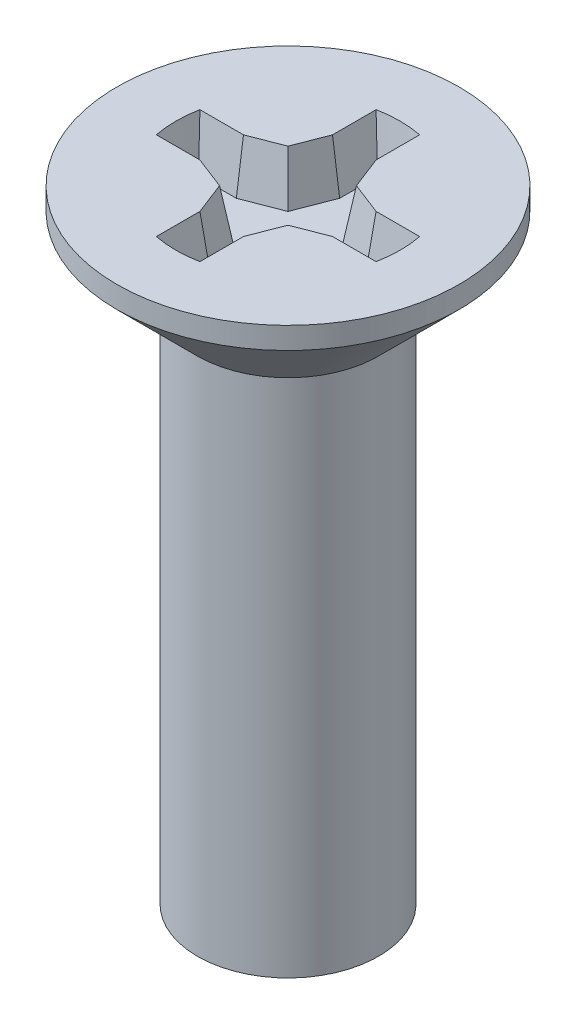
ISO-10303-21;
HEADER;
FILE_DESCRIPTION(('STEP AP214'),'2;1');
FILE_NAME('part.step','',(''),(''),'','','');
FILE_SCHEMA(('AUTOMOTIVE_DESIGN { 1 0 10303 214 1 1 1 1 }'));
ENDSEC;
DATA;
#1=APPLICATION_CONTEXT('core data for automotive mechanical design processes');
#2=APPLICATION_PROTOCOL_DEFINITION('international standard','automotive_design',2000,#1);
#3=PRODUCT_CONTEXT('',#1,'mechanical');
#4=PRODUCT('Part','Part','',(#3));
#5=PRODUCT_RELATED_PRODUCT_CATEGORY('part','',(#4));
#6=PRODUCT_DEFINITION_FORMATION('','',#4);
#7=PRODUCT_DEFINITION_CONTEXT('part definition',#1,'design');
#8=PRODUCT_DEFINITION('design','',#6,#7);
#9=PRODUCT_DEFINITION_SHAPE('','',#8);
#10=(LENGTH_UNIT() NAMED_UNIT(*) SI_UNIT(.MILLI.,.METRE.));
#11=(NAMED_UNIT(*) PLANE_ANGLE_UNIT() SI_UNIT($,.RADIAN.));
#12=(NAMED_UNIT(*) SI_UNIT($,.STERADIAN.) SOLID_ANGLE_UNIT());
#13=UNCERTAINTY_MEASURE_WITH_UNIT(LENGTH_MEASURE(1.E-05),#10,'distance_accuracy_value','');
#14=(GEOMETRIC_REPRESENTATION_CONTEXT(3) GLOBAL_UNCERTAINTY_ASSIGNED_CONTEXT((#13)) GLOBAL_UNIT_ASSIGNED_CONTEXT((#10,
#11,#12)) REPRESENTATION_CONTEXT('',''));
#15=CARTESIAN_POINT('',(0.,0.,0.));
#16=DIRECTION('',(0.,0.,1.));
#17=DIRECTION('',(1.,0.,0.));
#18=AXIS2_PLACEMENT_3D('',#15,#16,#17);
#19=CARTESIAN_POINT('',(0.,0.6475,0.));
#20=DIRECTION('',(0.,1.,0.));
#21=DIRECTION('',(0.,0.,-1.));
#22=AXIS2_PLACEMENT_3D('',#19,#20,#21);
#23=CONICAL_SURFACE('',#22,2.1025,0.785398163397449);
#24=CARTESIAN_POINT('',(0.,0.,0.));
#25=DIRECTION('',(0.,-1.,0.));
#26=DIRECTION('',(1.,0.,0.));
#27=AXIS2_PLACEMENT_3D('',#24,#25,#26);
#28=CIRCLE('',#27,1.455);
#29=CARTESIAN_POINT('',(0.,0.,-1.455));
#30=VERTEX_POINT('',#29);
#31=EDGE_CURVE('E417',#30,#30,#28,.T.);
#32=ORIENTED_EDGE('',*,*,#31,.F.);
#33=EDGE_LOOP('',(#32));
#34=FACE_BOUND('',#33,.T.);
#35=CARTESIAN_POINT('',(0.,1.295,0.));
#36=DIRECTION('',(0.,-1.,0.));
#37=DIRECTION('',(1.,0.,0.));
#38=AXIS2_PLACEMENT_3D('',#35,#36,#37);
#39=CIRCLE('',#38,2.75);
#40=CARTESIAN_POINT('',(0.,1.295,-2.75));
#41=VERTEX_POINT('',#40);
#42=EDGE_CURVE('E11',#41,#41,#39,.T.);
#43=ORIENTED_EDGE('',*,*,#42,.T.);
#44=EDGE_LOOP('',(#43));
#45=FACE_BOUND('',#44,.T.);
#46=ADVANCED_FACE('F16',(#34,#45),#23,.T.);
#47=CARTESIAN_POINT('',(0.,1.47,0.));
#48=DIRECTION('',(0.,-1.,0.));
#49=DIRECTION('',(0.,0.,-1.));
#50=AXIS2_PLACEMENT_3D('',#47,#48,#49);
#51=CYLINDRICAL_SURFACE('',#50,2.75);
#52=ORIENTED_EDGE('',*,*,#42,.F.);
#53=EDGE_LOOP('',(#52));
#54=FACE_BOUND('',#53,.T.);
#55=CARTESIAN_POINT('',(0.,1.645,0.));
#56=DIRECTION('',(0.,-1.,0.));
#57=DIRECTION('',(1.,0.,0.));
#58=AXIS2_PLACEMENT_3D('',#55,#56,#57);
#59=CIRCLE('',#58,2.75);
#60=CARTESIAN_POINT('',(0.,1.645,-2.75));
#61=VERTEX_POINT('',#60);
#62=EDGE_CURVE('E24',#61,#61,#59,.T.);
#63=ORIENTED_EDGE('',*,*,#62,.T.);
#64=EDGE_LOOP('',(#63));
#65=FACE_BOUND('',#64,.T.);
#66=ADVANCED_FACE('F500',(#54,#65),#51,.T.);
#67=CARTESIAN_POINT('',(0.,1.645,-2.75));
#68=DIRECTION('',(0.,1.,0.));
#69=DIRECTION('',(0.,0.,1.));
#70=AXIS2_PLACEMENT_3D('',#67,#68,#69);
#71=PLANE('',#70);
#72=DIRECTION('',(-0.361616294640554,0.,-0.932327011005493));
#73=VECTOR('',#72,1.);
#74=CARTESIAN_POINT('',(-0.35,1.645,1.06564435830096));
#75=LINE('',#74,#73);
#76=CARTESIAN_POINT('',(-0.35,1.645,1.06564435830096));
#77=VERTEX_POINT('',#76);
#78=CARTESIAN_POINT('',(-0.55,1.645,0.55));
#79=VERTEX_POINT('',#78);
#80=EDGE_CURVE('E165',#77,#79,#75,.T.);
#81=ORIENTED_EDGE('',*,*,#80,.T.);
#82=DIRECTION('',(-0.932327011005493,0.,-0.361616294640553));
#83=VECTOR('',#82,1.);
#84=CARTESIAN_POINT('',(-0.55,1.645,0.55));
#85=LINE('',#84,#83);
#86=CARTESIAN_POINT('',(-1.06564435830096,1.645,0.35));
#87=VERTEX_POINT('',#86);
#88=EDGE_CURVE('E411',#79,#87,#85,.T.);
#89=ORIENTED_EDGE('',*,*,#88,.T.);
#90=DIRECTION('',(-1.,0.,0.));
#91=VECTOR('',#90,1.);
#92=CARTESIAN_POINT('',(-1.06564435830096,1.645,0.35));
#93=LINE('',#92,#91);
#94=CARTESIAN_POINT('',(-1.76564435830096,1.645,0.35));
#95=VERTEX_POINT('',#94);
#96=EDGE_CURVE('E401',#87,#95,#93,.T.);
#97=ORIENTED_EDGE('',*,*,#96,.T.);
#98=CARTESIAN_POINT('',(0.,1.645,0.));
#99=DIRECTION('',(0.,-1.,0.));
#100=DIRECTION('',(0.980913532389421,0.,0.194444444444445));
#101=AXIS2_PLACEMENT_3D('',#98,#99,#100);
#102=CIRCLE('',#101,1.8);
#103=CARTESIAN_POINT('',(-1.76564435830096,1.645,-0.35));
#104=VERTEX_POINT('',#103);
#105=EDGE_CURVE('E386',#95,#104,#102,.T.);
#106=ORIENTED_EDGE('',*,*,#105,.T.);
#107=DIRECTION('',(1.,0.,0.));
#108=VECTOR('',#107,1.);
#109=CARTESIAN_POINT('',(-1.76564435830096,1.645,-0.35));
#110=LINE('',#109,#108);
#111=CARTESIAN_POINT('',(-1.06564435830096,1.645,-0.35));
#112=VERTEX_POINT('',#111);
#113=EDGE_CURVE('E371',#104,#112,#110,.T.);
#114=ORIENTED_EDGE('',*,*,#113,.T.);
#115=DIRECTION('',(0.932327011005492,0.,-0.361616294640555));
#116=VECTOR('',#115,1.);
#117=CARTESIAN_POINT('',(-1.06564435830096,1.645,-0.35));
#118=LINE('',#117,#116);
#119=CARTESIAN_POINT('',(-0.55,1.645,-0.55));
#120=VERTEX_POINT('',#119);
#121=EDGE_CURVE('E361',#112,#120,#118,.T.);
#122=ORIENTED_EDGE('',*,*,#121,.T.);
#123=DIRECTION('',(0.361616294640554,0.,-0.932327011005493));
#124=VECTOR('',#123,1.);
#125=CARTESIAN_POINT('',(-0.55,1.645,-0.55));
#126=LINE('',#125,#124);
#127=CARTESIAN_POINT('',(-0.35,1.645,-1.06564435830096));
#128=VERTEX_POINT('',#127);
#129=EDGE_CURVE('E351',#120,#128,#126,.T.);
#130=ORIENTED_EDGE('',*,*,#129,.T.);
#131=DIRECTION('',(0.,0.,-1.));
#132=VECTOR('',#131,1.);
#133=CARTESIAN_POINT('',(-0.35,1.645,-1.06564435830096));
#134=LINE('',#133,#132);
#135=CARTESIAN_POINT('',(-0.35,1.645,-1.76564435830095));
#136=VERTEX_POINT('',#135);
#137=EDGE_CURVE('E341',#128,#136,#134,.T.);
#138=ORIENTED_EDGE('',*,*,#137,.T.);
#139=CARTESIAN_POINT('',(0.,1.645,0.));
#140=DIRECTION('',(0.,-1.,0.));
#141=DIRECTION('',(-0.194444444444444,0.,0.980913532389421));
#142=AXIS2_PLACEMENT_3D('',#139,#140,#141);
#143=CIRCLE('',#142,1.8);
#144=CARTESIAN_POINT('',(0.35,1.645,-1.76564435830095));
#145=VERTEX_POINT('',#144);
#146=EDGE_CURVE('E326',#136,#145,#143,.T.);
#147=ORIENTED_EDGE('',*,*,#146,.T.);
#148=DIRECTION('',(0.,0.,1.));
#149=VECTOR('',#148,1.);
#150=CARTESIAN_POINT('',(0.35,1.645,-1.76564435830095));
#151=LINE('',#150,#149);
#152=CARTESIAN_POINT('',(0.35,1.645,-1.06564435830096));
#153=VERTEX_POINT('',#152);
#154=EDGE_CURVE('E311',#145,#153,#151,.T.);
#155=ORIENTED_EDGE('',*,*,#154,.T.);
#156=DIRECTION('',(0.361616294640555,0.,0.932327011005492));
#157=VECTOR('',#156,1.);
#158=CARTESIAN_POINT('',(0.35,1.645,-1.06564435830096));
#159=LINE('',#158,#157);
#160=CARTESIAN_POINT('',(0.55,1.645,-0.55));
#161=VERTEX_POINT('',#160);
#162=EDGE_CURVE('E301',#153,#161,#159,.T.);
#163=ORIENTED_EDGE('',*,*,#162,.T.);
#164=DIRECTION('',(0.932327011005493,0.,0.361616294640554));
#165=VECTOR('',#164,1.);
#166=CARTESIAN_POINT('',(0.55,1.645,-0.55));
#167=LINE('',#166,#165);
#168=CARTESIAN_POINT('',(1.06564435830096,1.645,-0.35));
#169=VERTEX_POINT('',#168);
#170=EDGE_CURVE('E291',#161,#169,#167,.T.);
#171=ORIENTED_EDGE('',*,*,#170,.T.);
#172=DIRECTION('',(1.,0.,0.));
#173=VECTOR('',#172,1.);
#174=CARTESIAN_POINT('',(1.06564435830096,1.645,-0.35));
#175=LINE('',#174,#173);
#176=CARTESIAN_POINT('',(1.76564435830096,1.645,-0.35));
#177=VERTEX_POINT('',#176);
#178=EDGE_CURVE('E281',#169,#177,#175,.T.);
#179=ORIENTED_EDGE('',*,*,#178,.T.);
#180=CARTESIAN_POINT('',(0.,1.645,0.));
#181=DIRECTION('',(0.,-1.,0.));
#182=DIRECTION('',(-0.980913532389421,0.,-0.194444444444444));
#183=AXIS2_PLACEMENT_3D('',#180,#181,#182);
#184=CIRCLE('',#183,1.8);
#185=CARTESIAN_POINT('',(1.76564435830096,1.645,0.35));
#186=VERTEX_POINT('',#185);
#187=EDGE_CURVE('E266',#177,#186,#184,.T.);
#188=ORIENTED_EDGE('',*,*,#187,.T.);
#189=DIRECTION('',(-1.,0.,0.));
#190=VECTOR('',#189,1.);
#191=CARTESIAN_POINT('',(1.76564435830096,1.645,0.35));
#192=LINE('',#191,#190);
#193=CARTESIAN_POINT('',(1.06564435830096,1.645,0.35));
#194=VERTEX_POINT('',#193);
#195=EDGE_CURVE('E251',#186,#194,#192,.T.);
#196=ORIENTED_EDGE('',*,*,#195,.T.);
#197=DIRECTION('',(-0.932327011005492,0.,0.361616294640555));
#198=VECTOR('',#197,1.);
#199=CARTESIAN_POINT('',(1.06564435830096,1.645,0.35));
#200=LINE('',#199,#198);
#201=CARTESIAN_POINT('',(0.55,1.645,0.55));
#202=VERTEX_POINT('',#201);
#203=EDGE_CURVE('E241',#194,#202,#200,.T.);
#204=ORIENTED_EDGE('',*,*,#203,.T.);
#205=DIRECTION('',(-0.361616294640554,0.,0.932327011005493));
#206=VECTOR('',#205,1.);
#207=CARTESIAN_POINT('',(0.55,1.645,0.55));
#208=LINE('',#207,#206);
#209=CARTESIAN_POINT('',(0.35,1.645,1.06564435830096));
#210=VERTEX_POINT('',#209);
#211=EDGE_CURVE('E231',#202,#210,#208,.T.);
#212=ORIENTED_EDGE('',*,*,#211,.T.);
#213=DIRECTION('',(0.,0.,1.));
#214=VECTOR('',#213,1.);
#215=CARTESIAN_POINT('',(0.35,1.645,1.06564435830096));
#216=LINE('',#215,#214);
#217=CARTESIAN_POINT('',(0.35,1.645,1.76564435830096));
#218=VERTEX_POINT('',#217);
#219=EDGE_CURVE('E221',#210,#218,#216,.T.);
#220=ORIENTED_EDGE('',*,*,#219,.T.);
#221=CARTESIAN_POINT('',(0.,1.645,0.));
#222=DIRECTION('',(0.,-1.,0.));
#223=DIRECTION('',(0.194444444444444,0.,-0.980913532389421));
#224=AXIS2_PLACEMENT_3D('',#221,#222,#223);
#225=CIRCLE('',#224,1.8);
#226=CARTESIAN_POINT('',(-0.35,1.645,1.76564435830096));
#227=VERTEX_POINT('',#226);
#228=EDGE_CURVE('E167',#218,#227,#225,.T.);
#229=ORIENTED_EDGE('',*,*,#228,.T.);
#230=DIRECTION('',(0.,0.,-1.));
#231=VECTOR('',#230,1.);
#232=CARTESIAN_POINT('',(-0.35,1.645,1.76564435830096));
#233=LINE('',#232,#231);
#234=EDGE_CURVE('E160',#227,#77,#233,.T.);
#235=ORIENTED_EDGE('',*,*,#234,.T.);
#236=EDGE_LOOP('',(#81,#89,#97,#106,#114,#122,#130,#138,#147,#155,#163,#171,#179,#188,#196,#204,
#212,#220,#229,#235));
#237=FACE_BOUND('',#236,.T.);
#238=ORIENTED_EDGE('',*,*,#62,.F.);
#239=EDGE_LOOP('',(#238));
#240=FACE_BOUND('',#239,.T.);
#241=ADVANCED_FACE('F162',(#237,#240),#71,.T.);
#242=CARTESIAN_POINT('',(0.,-8.355,0.));
#243=DIRECTION('',(0.,-1.,0.));
#244=DIRECTION('',(0.,0.,-1.));
#245=AXIS2_PLACEMENT_3D('',#242,#243,#244);
#246=PLANE('',#245);
#247=CARTESIAN_POINT('',(0.,-8.355,0.));
#248=DIRECTION('',(0.,-1.,0.));
#249=DIRECTION('',(1.,0.,0.));
#250=AXIS2_PLACEMENT_3D('',#247,#248,#249);
#251=CIRCLE('',#250,1.455);
#252=CARTESIAN_POINT('',(0.,-8.355,-1.455));
#253=VERTEX_POINT('',#252);
#254=EDGE_CURVE('E420',#253,#253,#251,.T.);
#255=ORIENTED_EDGE('',*,*,#254,.T.);
#256=EDGE_LOOP('',(#255));
#257=FACE_BOUND('',#256,.T.);
#258=ADVANCED_FACE('F490',(#257),#246,.T.);
#259=CARTESIAN_POINT('',(0.,-4.1775,0.));
#260=DIRECTION('',(0.,-1.,0.));
#261=DIRECTION('',(0.,0.,-1.));
#262=AXIS2_PLACEMENT_3D('',#259,#260,#261);
#263=CYLINDRICAL_SURFACE('',#262,1.455);
#264=ORIENTED_EDGE('',*,*,#254,.F.);
#265=EDGE_LOOP('',(#264));
#266=FACE_BOUND('',#265,.T.);
#267=ORIENTED_EDGE('',*,*,#31,.T.);
#268=EDGE_LOOP('',(#267));
#269=FACE_BOUND('',#268,.T.);
#270=ADVANCED_FACE('F492',(#266,#269),#263,.T.);
#271=CARTESIAN_POINT('',(-0.925519669670004,0.845,0.));
#272=DIRECTION('',(0.,1.,0.));
#273=DIRECTION('',(0.,0.,1.));
#274=AXIS2_PLACEMENT_3D('',#271,#272,#273);
#275=PLANE('',#274);
#276=DIRECTION('',(-0.932327011005493,0.,-0.361616294640553));
#277=VECTOR('',#276,1.);
#278=CARTESIAN_POINT('',(-0.440983179903434,0.845,0.440983179903433));
#279=LINE('',#278,#277);
#280=CARTESIAN_POINT('',(-0.440983179903434,0.845,0.440983179903433));
#281=VERTEX_POINT('',#280);
#282=CARTESIAN_POINT('',(-1.03924604826511,0.845,0.208938415433228));
#283=VERTEX_POINT('',#282);
#284=EDGE_CURVE('E414',#281,#283,#279,.T.);
#285=ORIENTED_EDGE('',*,*,#284,.F.);
#286=DIRECTION('',(-0.361616294640555,0.,-0.932327011005492));
#287=VECTOR('',#286,1.);
#288=CARTESIAN_POINT('',(-0.208938415433227,0.845,1.03924604826511));
#289=LINE('',#288,#287);
#290=CARTESIAN_POINT('',(-0.208938415433227,0.845,1.03924604826511));
#291=VERTEX_POINT('',#290);
#292=EDGE_CURVE('E184',#291,#281,#289,.T.);
#293=ORIENTED_EDGE('',*,*,#292,.F.);
#294=DIRECTION('',(0.,0.,-1.));
#295=VECTOR('',#294,1.);
#296=CARTESIAN_POINT('',(-0.208938415433227,0.845,1.64572822931259));
#297=LINE('',#296,#295);
#298=CARTESIAN_POINT('',(-0.208938415433227,0.845,1.64572822931259));
#299=VERTEX_POINT('',#298);
#300=EDGE_CURVE('E179',#299,#291,#297,.T.);
#301=ORIENTED_EDGE('',*,*,#300,.F.);
#302=CARTESIAN_POINT('',(0.,0.845,0.));
#303=DIRECTION('',(0.,-1.,0.));
#304=DIRECTION('',(0.194444444444444,0.,-0.980913532389421));
#305=AXIS2_PLACEMENT_3D('',#302,#303,#304);
#306=CIRCLE('',#305,1.65893841543323);
#307=CARTESIAN_POINT('',(0.208938415433228,0.845,1.64572822931259));
#308=VERTEX_POINT('',#307);
#309=EDGE_CURVE('E215',#308,#299,#306,.T.);
#310=ORIENTED_EDGE('',*,*,#309,.F.);
#311=DIRECTION('',(0.,0.,1.));
#312=VECTOR('',#311,1.);
#313=CARTESIAN_POINT('',(0.208938415433228,0.845,1.03924604826511));
#314=LINE('',#313,#312);
#315=CARTESIAN_POINT('',(0.208938415433228,0.845,1.03924604826511));
#316=VERTEX_POINT('',#315);
#317=EDGE_CURVE('E228',#316,#308,#314,.T.);
#318=ORIENTED_EDGE('',*,*,#317,.F.);
#319=DIRECTION('',(-0.361616294640553,0.,0.932327011005493));
#320=VECTOR('',#319,1.);
#321=CARTESIAN_POINT('',(0.440983179903432,0.845,0.440983179903435));
#322=LINE('',#321,#320);
#323=CARTESIAN_POINT('',(0.440983179903432,0.845,0.440983179903435));
#324=VERTEX_POINT('',#323);
#325=EDGE_CURVE('E238',#324,#316,#322,.T.);
#326=ORIENTED_EDGE('',*,*,#325,.F.);
#327=DIRECTION('',(-0.932327011005492,0.,0.361616294640555));
#328=VECTOR('',#327,1.);
#329=CARTESIAN_POINT('',(1.03924604826511,0.845,0.208938415433228));
#330=LINE('',#329,#328);
#331=CARTESIAN_POINT('',(1.03924604826511,0.845,0.208938415433228));
#332=VERTEX_POINT('',#331);
#333=EDGE_CURVE('E248',#332,#324,#330,.T.);
#334=ORIENTED_EDGE('',*,*,#333,.F.);
#335=DIRECTION('',(-1.,0.,0.));
#336=VECTOR('',#335,1.);
#337=CARTESIAN_POINT('',(1.64572822931259,0.845,0.208938415433228));
#338=LINE('',#337,#336);
#339=CARTESIAN_POINT('',(1.64572822931259,0.845,0.208938415433228));
#340=VERTEX_POINT('',#339);
#341=EDGE_CURVE('E260',#340,#332,#338,.T.);
#342=ORIENTED_EDGE('',*,*,#341,.F.);
#343=CARTESIAN_POINT('',(0.,0.845,0.));
#344=DIRECTION('',(0.,-1.,0.));
#345=DIRECTION('',(-0.980913532389421,0.,-0.194444444444444));
#346=AXIS2_PLACEMENT_3D('',#343,#344,#345);
#347=CIRCLE('',#346,1.65893841543323);
#348=CARTESIAN_POINT('',(1.64572822931259,0.845,-0.208938415433228));
#349=VERTEX_POINT('',#348);
#350=EDGE_CURVE('E275',#349,#340,#347,.T.);
#351=ORIENTED_EDGE('',*,*,#350,.F.);
#352=DIRECTION('',(1.,0.,0.));
#353=VECTOR('',#352,1.);
#354=CARTESIAN_POINT('',(1.03924604826511,0.845,-0.208938415433227));
#355=LINE('',#354,#353);
#356=CARTESIAN_POINT('',(1.03924604826511,0.845,-0.208938415433227));
#357=VERTEX_POINT('',#356);
#358=EDGE_CURVE('E288',#357,#349,#355,.T.);
#359=ORIENTED_EDGE('',*,*,#358,.F.);
#360=DIRECTION('',(0.932327011005493,0.,0.361616294640553));
#361=VECTOR('',#360,1.);
#362=CARTESIAN_POINT('',(0.440983179903433,0.845,-0.440983179903432));
#363=LINE('',#362,#361);
#364=CARTESIAN_POINT('',(0.440983179903433,0.845,-0.440983179903432));
#365=VERTEX_POINT('',#364);
#366=EDGE_CURVE('E298',#365,#357,#363,.T.);
#367=ORIENTED_EDGE('',*,*,#366,.F.);
#368=DIRECTION('',(0.361616294640555,0.,0.932327011005492));
#369=VECTOR('',#368,1.);
#370=CARTESIAN_POINT('',(0.208938415433228,0.845,-1.03924604826511));
#371=LINE('',#370,#369);
#372=CARTESIAN_POINT('',(0.208938415433228,0.845,-1.03924604826511));
#373=VERTEX_POINT('',#372);
#374=EDGE_CURVE('E308',#373,#365,#371,.T.);
#375=ORIENTED_EDGE('',*,*,#374,.F.);
#376=DIRECTION('',(0.,0.,1.));
#377=VECTOR('',#376,1.);
#378=CARTESIAN_POINT('',(0.208938415433228,0.845,-1.64572822931259));
#379=LINE('',#378,#377);
#380=CARTESIAN_POINT('',(0.208938415433228,0.845,-1.64572822931259));
#381=VERTEX_POINT('',#380);
#382=EDGE_CURVE('E320',#381,#373,#379,.T.);
#383=ORIENTED_EDGE('',*,*,#382,.F.);
#384=CARTESIAN_POINT('',(0.,0.845,0.));
#385=DIRECTION('',(0.,-1.,0.));
#386=DIRECTION('',(-0.194444444444444,0.,0.980913532389421));
#387=AXIS2_PLACEMENT_3D('',#384,#385,#386);
#388=CIRCLE('',#387,1.65893841543323);
#389=CARTESIAN_POINT('',(-0.208938415433228,0.845,-1.64572822931259));
#390=VERTEX_POINT('',#389);
#391=EDGE_CURVE('E335',#390,#381,#388,.T.);
#392=ORIENTED_EDGE('',*,*,#391,.F.);
#393=DIRECTION('',(0.,0.,-1.));
#394=VECTOR('',#393,1.);
#395=CARTESIAN_POINT('',(-0.208938415433228,0.845,-1.03924604826511));
#396=LINE('',#395,#394);
#397=CARTESIAN_POINT('',(-0.208938415433228,0.845,-1.03924604826511));
#398=VERTEX_POINT('',#397);
#399=EDGE_CURVE('E348',#398,#390,#396,.T.);
#400=ORIENTED_EDGE('',*,*,#399,.F.);
#401=DIRECTION('',(0.361616294640553,0.,-0.932327011005493));
#402=VECTOR('',#401,1.);
#403=CARTESIAN_POINT('',(-0.440983179903432,0.845,-0.440983179903433));
#404=LINE('',#403,#402);
#405=CARTESIAN_POINT('',(-0.440983179903432,0.845,-0.440983179903433));
#406=VERTEX_POINT('',#405);
#407=EDGE_CURVE('E358',#406,#398,#404,.T.);
#408=ORIENTED_EDGE('',*,*,#407,.F.);
#409=DIRECTION('',(0.932327011005492,0.,-0.361616294640555));
#410=VECTOR('',#409,1.);
#411=CARTESIAN_POINT('',(-1.03924604826511,0.845,-0.208938415433227));
#412=LINE('',#411,#410);
#413=CARTESIAN_POINT('',(-1.03924604826511,0.845,-0.208938415433227));
#414=VERTEX_POINT('',#413);
#415=EDGE_CURVE('E368',#414,#406,#412,.T.);
#416=ORIENTED_EDGE('',*,*,#415,.F.);
#417=DIRECTION('',(1.,0.,0.));
#418=VECTOR('',#417,1.);
#419=CARTESIAN_POINT('',(-1.64572822931259,0.845,-0.208938415433227));
#420=LINE('',#419,#418);
#421=CARTESIAN_POINT('',(-1.64572822931259,0.845,-0.208938415433227));
#422=VERTEX_POINT('',#421);
#423=EDGE_CURVE('E380',#422,#414,#420,.T.);
#424=ORIENTED_EDGE('',*,*,#423,.F.);
#425=CARTESIAN_POINT('',(0.,0.845,0.));
#426=DIRECTION('',(0.,-1.,0.));
#427=DIRECTION('',(0.980913532389421,0.,0.194444444444444));
#428=AXIS2_PLACEMENT_3D('',#425,#426,#427);
#429=CIRCLE('',#428,1.65893841543323);
#430=CARTESIAN_POINT('',(-1.64572822931259,0.845,0.208938415433228));
#431=VERTEX_POINT('',#430);
#432=EDGE_CURVE('E395',#431,#422,#429,.T.);
#433=ORIENTED_EDGE('',*,*,#432,.F.);
#434=DIRECTION('',(-1.,0.,0.));
#435=VECTOR('',#434,1.);
#436=CARTESIAN_POINT('',(-1.03924604826511,0.845,0.208938415433228));
#437=LINE('',#436,#435);
#438=EDGE_CURVE('E408',#283,#431,#437,.T.);
#439=ORIENTED_EDGE('',*,*,#438,.F.);
#440=EDGE_LOOP('',(#285,#293,#301,#310,#318,#326,#334,#342,#351,#359,#367,#375,#383,#392,#400,
#408,#416,#424,#433,#439));
#441=FACE_BOUND('',#440,.T.);
#442=ADVANCED_FACE('F495',(#441),#275,.T.);
#443=CARTESIAN_POINT('',(-0.55,1.645,0.55));
#444=DIRECTION('',(0.356122530577563,0.173648177666931,-0.918162868780908));
#445=DIRECTION('',(-0.932327011005493,0.,-0.361616294640553));
#446=AXIS2_PLACEMENT_3D('',#443,#444,#445);
#447=PLANE('',#446);
#448=ORIENTED_EDGE('',*,*,#88,.F.);
#449=DIRECTION('',(0.133808874519465,-0.98193195802951,-0.133808874519467));
#450=VECTOR('',#449,1.);
#451=CARTESIAN_POINT('',(-0.55,1.645,0.55));
#452=LINE('',#451,#450);
#453=EDGE_CURVE('E173',#79,#281,#452,.T.);
#454=ORIENTED_EDGE('',*,*,#453,.T.);
#455=ORIENTED_EDGE('',*,*,#284,.T.);
#456=DIRECTION('',(0.0324794304278367,-0.98428817249995,-0.173556561603969));
#457=VECTOR('',#456,1.);
#458=CARTESIAN_POINT('',(-1.06564435830096,1.645,0.35));
#459=LINE('',#458,#457);
#460=EDGE_CURVE('E404',#87,#283,#459,.T.);
#461=ORIENTED_EDGE('',*,*,#460,.F.);
#462=EDGE_LOOP('',(#448,#454,#455,#461));
#463=FACE_BOUND('',#462,.T.);
#464=ADVANCED_FACE('F514',(#463),#447,.T.);
#465=CARTESIAN_POINT('',(-1.06564435830096,1.645,0.35));
#466=DIRECTION('',(0.,0.173648177666931,-0.984807753012208));
#467=DIRECTION('',(-1.,0.,0.));
#468=AXIS2_PLACEMENT_3D('',#465,#466,#467);
#469=PLANE('',#468);
#470=ORIENTED_EDGE('',*,*,#96,.F.);
#471=ORIENTED_EDGE('',*,*,#460,.T.);
#472=ORIENTED_EDGE('',*,*,#438,.T.);
#473=CARTESIAN_POINT('',(-1.76564435823342,1.64500000001858,0.350000000003208));
#474=CARTESIAN_POINT('',(-1.70568629373533,1.23093925162449,0.276989918408984));
#475=CARTESIAN_POINT('',(-1.64572822923726,0.845000000000162,0.208938415433181));
#476=(BOUNDED_CURVE() B_SPLINE_CURVE(2,(#473,#474,#475),.UNSPECIFIED.,.F.,
.F.) B_SPLINE_CURVE_WITH_KNOTS((3,3),(95.2082817219201,95.7512084471716),
.UNSPECIFIED.) CURVE() GEOMETRIC_REPRESENTATION_ITEM() RATIONAL_B_SPLINE_CURVE((1.,1.,1.)) REPRESENTATION_ITEM(''));
#477=EDGE_CURVE('E389',#95,#431,#476,.T.);
#478=ORIENTED_EDGE('',*,*,#477,.F.);
#479=EDGE_LOOP('',(#470,#471,#472,#478));
#480=FACE_BOUND('',#479,.T.);
#481=ADVANCED_FACE('F518',(#480),#469,.T.);
#482=CARTESIAN_POINT('',(0.,1.645,0.));
#483=DIRECTION('',(0.,1.,0.));
#484=DIRECTION('',(0.980913532389421,0.,0.194444444444445));
#485=AXIS2_PLACEMENT_3D('',#482,#483,#484);
#486=CONICAL_SURFACE('',#485,1.8,0.174532925199433);
#487=ORIENTED_EDGE('',*,*,#105,.F.);
#488=ORIENTED_EDGE('',*,*,#477,.T.);
#489=ORIENTED_EDGE('',*,*,#432,.T.);
#490=CARTESIAN_POINT('',(-1.76564435826637,1.64500000000652,-0.349999999995762));
#491=CARTESIAN_POINT('',(-1.70568629377021,1.23093925161933,-0.276989918402762));
#492=CARTESIAN_POINT('',(-1.64572822927405,0.845000000000034,-0.208938415427845));
#493=(BOUNDED_CURVE() B_SPLINE_CURVE(2,(#490,#491,#492),.UNSPECIFIED.,.F.,
.F.) B_SPLINE_CURVE_WITH_KNOTS((3,3),(-111.196381361369,-110.653454636136),
.UNSPECIFIED.) CURVE() GEOMETRIC_REPRESENTATION_ITEM() RATIONAL_B_SPLINE_CURVE((1.,1.,1.)) REPRESENTATION_ITEM(''));
#494=EDGE_CURVE('E374',#104,#422,#493,.T.);
#495=ORIENTED_EDGE('',*,*,#494,.F.);
#496=EDGE_LOOP('',(#487,#488,#489,#495));
#497=FACE_BOUND('',#496,.T.);
#498=ADVANCED_FACE('F522',(#497),#486,.F.);
#499=CARTESIAN_POINT('',(-1.76564435830096,1.645,-0.35));
#500=DIRECTION('',(0.,0.173648177666929,0.984807753012208));
#501=DIRECTION('',(1.,0.,0.));
#502=AXIS2_PLACEMENT_3D('',#499,#500,#501);
#503=PLANE('',#502);
#504=ORIENTED_EDGE('',*,*,#113,.F.);
#505=ORIENTED_EDGE('',*,*,#494,.T.);
#506=ORIENTED_EDGE('',*,*,#423,.T.);
#507=DIRECTION('',(0.0324794304278369,-0.98428817249995,0.173556561603968));
#508=VECTOR('',#507,1.);
#509=CARTESIAN_POINT('',(-1.06564435830096,1.645,-0.35));
#510=LINE('',#509,#508);
#511=EDGE_CURVE('E364',#112,#414,#510,.T.);
#512=ORIENTED_EDGE('',*,*,#511,.F.);
#513=EDGE_LOOP('',(#504,#505,#506,#512));
#514=FACE_BOUND('',#513,.T.);
#515=ADVANCED_FACE('F526',(#514),#503,.T.);
#516=CARTESIAN_POINT('',(-1.06564435830096,1.645,-0.35));
#517=DIRECTION('',(0.356122530577565,0.173648177666929,0.918162868780907));
#518=DIRECTION('',(0.932327011005492,0.,-0.361616294640555));
#519=AXIS2_PLACEMENT_3D('',#516,#517,#518);
#520=PLANE('',#519);
#521=ORIENTED_EDGE('',*,*,#121,.F.);
#522=ORIENTED_EDGE('',*,*,#511,.T.);
#523=ORIENTED_EDGE('',*,*,#415,.T.);
#524=DIRECTION('',(0.133808874519467,-0.98193195802951,0.133808874519465));
#525=VECTOR('',#524,1.);
#526=CARTESIAN_POINT('',(-0.55,1.645,-0.55));
#527=LINE('',#526,#525);
#528=EDGE_CURVE('E354',#120,#406,#527,.T.);
#529=ORIENTED_EDGE('',*,*,#528,.F.);
#530=EDGE_LOOP('',(#521,#522,#523,#529));
#531=FACE_BOUND('',#530,.T.);
#532=ADVANCED_FACE('F530',(#531),#520,.T.);
#533=CARTESIAN_POINT('',(-0.55,1.645,-0.55));
#534=DIRECTION('',(0.918162868780908,0.17364817766693,0.356122530577563));
#535=DIRECTION('',(0.361616294640553,0.,-0.932327011005493));
#536=AXIS2_PLACEMENT_3D('',#533,#534,#535);
#537=PLANE('',#536);
#538=ORIENTED_EDGE('',*,*,#129,.F.);
#539=ORIENTED_EDGE('',*,*,#528,.T.);
#540=ORIENTED_EDGE('',*,*,#407,.T.);
#541=DIRECTION('',(0.173556561603969,-0.98428817249995,0.0324794304278352));
#542=VECTOR('',#541,1.);
#543=CARTESIAN_POINT('',(-0.35,1.645,-1.06564435830096));
#544=LINE('',#543,#542);
#545=EDGE_CURVE('E344',#128,#398,#544,.T.);
#546=ORIENTED_EDGE('',*,*,#545,.F.);
#547=EDGE_LOOP('',(#538,#539,#540,#546));
#548=FACE_BOUND('',#547,.T.);
#549=ADVANCED_FACE('F534',(#548),#537,.T.);
#550=CARTESIAN_POINT('',(-0.35,1.645,-1.06564435830096));
#551=DIRECTION('',(0.984807753012208,0.17364817766693,0.));
#552=DIRECTION('',(0.,0.,-1.));
#553=AXIS2_PLACEMENT_3D('',#550,#551,#552);
#554=PLANE('',#553);
#555=ORIENTED_EDGE('',*,*,#137,.F.);
#556=ORIENTED_EDGE('',*,*,#545,.T.);
#557=ORIENTED_EDGE('',*,*,#399,.T.);
#558=CARTESIAN_POINT('',(-0.349999999998366,1.6450000000112,-1.76564435830309));
#559=CARTESIAN_POINT('',(-0.27698991840504,1.23093925162215,-1.70568629380803));
#560=CARTESIAN_POINT('',(-0.208938415429625,0.845000000000025,-1.64572822931295));
#561=(BOUNDED_CURVE() B_SPLINE_CURVE(2,(#558,#559,#560),.UNSPECIFIED.,.F.,
.F.) B_SPLINE_CURVE_WITH_KNOTS((3,3),(95.2082817216562,95.75120844688),
.UNSPECIFIED.) CURVE() GEOMETRIC_REPRESENTATION_ITEM() RATIONAL_B_SPLINE_CURVE((1.,1.,1.)) REPRESENTATION_ITEM(''));
#562=EDGE_CURVE('E329',#136,#390,#561,.T.);
#563=ORIENTED_EDGE('',*,*,#562,.F.);
#564=EDGE_LOOP('',(#555,#556,#557,#563));
#565=FACE_BOUND('',#564,.T.);
#566=ADVANCED_FACE('F538',(#565),#554,.T.);
#567=CARTESIAN_POINT('',(0.,1.645,0.));
#568=DIRECTION('',(0.,1.,0.));
#569=DIRECTION('',(-0.194444444444444,0.,0.980913532389421));
#570=AXIS2_PLACEMENT_3D('',#567,#568,#569);
#571=CONICAL_SURFACE('',#570,1.8,0.174532925199433);
#572=ORIENTED_EDGE('',*,*,#146,.F.);
#573=ORIENTED_EDGE('',*,*,#562,.T.);
#574=ORIENTED_EDGE('',*,*,#391,.T.);
#575=CARTESIAN_POINT('',(0.34999999999782,1.64500000000801,-1.76564435830269));
#576=CARTESIAN_POINT('',(0.276989918404798,1.23093925162074,-1.70568629380786));
#577=CARTESIAN_POINT('',(0.208938415429653,0.845000000000145,-1.64572822931303));
#578=(BOUNDED_CURVE() B_SPLINE_CURVE(2,(#575,#576,#577),.UNSPECIFIED.,.F.,
.F.) B_SPLINE_CURVE_WITH_KNOTS((3,3),(95.2082817216581,95.7512084468797),
.UNSPECIFIED.) CURVE() GEOMETRIC_REPRESENTATION_ITEM() RATIONAL_B_SPLINE_CURVE((1.,1.,1.)) REPRESENTATION_ITEM(''));
#579=EDGE_CURVE('E314',#145,#381,#578,.T.);
#580=ORIENTED_EDGE('',*,*,#579,.F.);
#581=EDGE_LOOP('',(#572,#573,#574,#580));
#582=FACE_BOUND('',#581,.T.);
#583=ADVANCED_FACE('F542',(#582),#571,.F.);
#584=CARTESIAN_POINT('',(0.35,1.645,-1.76564435830095));
#585=DIRECTION('',(-0.984807753012208,0.17364817766693,0.));
#586=DIRECTION('',(0.,0.,1.));
#587=AXIS2_PLACEMENT_3D('',#584,#585,#586);
#588=PLANE('',#587);
#589=ORIENTED_EDGE('',*,*,#154,.F.);
#590=ORIENTED_EDGE('',*,*,#579,.T.);
#591=ORIENTED_EDGE('',*,*,#382,.T.);
#592=DIRECTION('',(-0.173556561603969,-0.98428817249995,0.0324794304278369));
#593=VECTOR('',#592,1.);
#594=CARTESIAN_POINT('',(0.35,1.645,-1.06564435830096));
#595=LINE('',#594,#593);
#596=EDGE_CURVE('E304',#153,#373,#595,.T.);
#597=ORIENTED_EDGE('',*,*,#596,.F.);
#598=EDGE_LOOP('',(#589,#590,#591,#597));
#599=FACE_BOUND('',#598,.T.);
#600=ADVANCED_FACE('F546',(#599),#588,.T.);
#601=CARTESIAN_POINT('',(0.35,1.645,-1.06564435830096));
#602=DIRECTION('',(-0.918162868780907,0.17364817766693,0.356122530577565));
#603=DIRECTION('',(0.361616294640555,0.,0.932327011005492));
#604=AXIS2_PLACEMENT_3D('',#601,#602,#603);
#605=PLANE('',#604);
#606=ORIENTED_EDGE('',*,*,#162,.F.);
#607=ORIENTED_EDGE('',*,*,#596,.T.);
#608=ORIENTED_EDGE('',*,*,#374,.T.);
#609=DIRECTION('',(-0.133808874519466,-0.98193195802951,0.133808874519466));
#610=VECTOR('',#609,1.);
#611=CARTESIAN_POINT('',(0.55,1.645,-0.55));
#612=LINE('',#611,#610);
#613=EDGE_CURVE('E294',#161,#365,#612,.T.);
#614=ORIENTED_EDGE('',*,*,#613,.F.);
#615=EDGE_LOOP('',(#606,#607,#608,#614));
#616=FACE_BOUND('',#615,.T.);
#617=ADVANCED_FACE('F550',(#616),#605,.T.);
#618=CARTESIAN_POINT('',(0.55,1.645,-0.55));
#619=DIRECTION('',(-0.356122530577563,0.17364817766693,0.918162868780908));
#620=DIRECTION('',(0.932327011005493,0.,0.361616294640553));
#621=AXIS2_PLACEMENT_3D('',#618,#619,#620);
#622=PLANE('',#621);
#623=ORIENTED_EDGE('',*,*,#170,.F.);
#624=ORIENTED_EDGE('',*,*,#613,.T.);
#625=ORIENTED_EDGE('',*,*,#366,.T.);
#626=DIRECTION('',(-0.0324794304278367,-0.98428817249995,0.173556561603968));
#627=VECTOR('',#626,1.);
#628=CARTESIAN_POINT('',(1.06564435830096,1.645,-0.35));
#629=LINE('',#628,#627);
#630=EDGE_CURVE('E284',#169,#357,#629,.T.);
#631=ORIENTED_EDGE('',*,*,#630,.F.);
#632=EDGE_LOOP('',(#623,#624,#625,#631));
#633=FACE_BOUND('',#632,.T.);
#634=ADVANCED_FACE('F554',(#633),#622,.T.);
#635=CARTESIAN_POINT('',(1.06564435830096,1.645,-0.35));
#636=DIRECTION('',(0.,0.173648177666929,0.984807753012208));
#637=DIRECTION('',(1.,0.,0.));
#638=AXIS2_PLACEMENT_3D('',#635,#636,#637);
#639=PLANE('',#638);
#640=ORIENTED_EDGE('',*,*,#178,.F.);
#641=ORIENTED_EDGE('',*,*,#630,.T.);
#642=ORIENTED_EDGE('',*,*,#358,.T.);
#643=CARTESIAN_POINT('',(1.76564435836754,1.64499999999372,-0.349999999997087));
#644=CARTESIAN_POINT('',(1.70568629387626,1.23093925161524,-0.276989918405617));
#645=CARTESIAN_POINT('',(1.64572822938498,0.84500000000014,-0.208938415431442));
#646=(BOUNDED_CURVE() B_SPLINE_CURVE(2,(#643,#644,#645),.UNSPECIFIED.,.F.,
.F.) B_SPLINE_CURVE_WITH_KNOTS((3,3),(95.2082817214066,95.7512084465966),
.UNSPECIFIED.) CURVE() GEOMETRIC_REPRESENTATION_ITEM() RATIONAL_B_SPLINE_CURVE((1.,1.,1.)) REPRESENTATION_ITEM(''));
#647=EDGE_CURVE('E269',#177,#349,#646,.T.);
#648=ORIENTED_EDGE('',*,*,#647,.F.);
#649=EDGE_LOOP('',(#640,#641,#642,#648));
#650=FACE_BOUND('',#649,.T.);
#651=ADVANCED_FACE('F558',(#650),#639,.T.);
#652=CARTESIAN_POINT('',(0.,1.645,0.));
#653=DIRECTION('',(0.,1.,0.));
#654=DIRECTION('',(-0.980913532389421,0.,-0.194444444444444));
#655=AXIS2_PLACEMENT_3D('',#652,#653,#654);
#656=CONICAL_SURFACE('',#655,1.8,0.174532925199433);
#657=ORIENTED_EDGE('',*,*,#187,.F.);
#658=ORIENTED_EDGE('',*,*,#647,.T.);
#659=ORIENTED_EDGE('',*,*,#350,.T.);
#660=CARTESIAN_POINT('',(1.76564435823663,1.64500000002003,0.350000000003562));
#661=CARTESIAN_POINT('',(1.70568629373856,1.23093925162518,0.276989918409211));
#662=CARTESIAN_POINT('',(1.64572822924047,0.845000000000109,0.208938415433277));
#663=(BOUNDED_CURVE() B_SPLINE_CURVE(2,(#660,#661,#662),.UNSPECIFIED.,.F.,
.F.) B_SPLINE_CURVE_WITH_KNOTS((3,3),(95.2082817219076,95.751208447159),
.UNSPECIFIED.) CURVE() GEOMETRIC_REPRESENTATION_ITEM() RATIONAL_B_SPLINE_CURVE((1.,1.,1.)) REPRESENTATION_ITEM(''));
#664=EDGE_CURVE('E254',#186,#340,#663,.T.);
#665=ORIENTED_EDGE('',*,*,#664,.F.);
#666=EDGE_LOOP('',(#657,#658,#659,#665));
#667=FACE_BOUND('',#666,.T.);
#668=ADVANCED_FACE('F562',(#667),#656,.F.);
#669=CARTESIAN_POINT('',(1.76564435830096,1.645,0.35));
#670=DIRECTION('',(0.,0.173648177666931,-0.984807753012208));
#671=DIRECTION('',(-1.,0.,0.));
#672=AXIS2_PLACEMENT_3D('',#669,#670,#671);
#673=PLANE('',#672);
#674=ORIENTED_EDGE('',*,*,#195,.F.);
#675=ORIENTED_EDGE('',*,*,#664,.T.);
#676=ORIENTED_EDGE('',*,*,#341,.T.);
#677=DIRECTION('',(-0.0324794304278364,-0.98428817249995,-0.173556561603969));
#678=VECTOR('',#677,1.);
#679=CARTESIAN_POINT('',(1.06564435830096,1.645,0.35));
#680=LINE('',#679,#678);
#681=EDGE_CURVE('E244',#194,#332,#680,.T.);
#682=ORIENTED_EDGE('',*,*,#681,.F.);
#683=EDGE_LOOP('',(#674,#675,#676,#682));
#684=FACE_BOUND('',#683,.T.);
#685=ADVANCED_FACE('F566',(#684),#673,.T.);
#686=CARTESIAN_POINT('',(1.06564435830096,1.645,0.35));
#687=DIRECTION('',(-0.356122530577565,0.173648177666931,-0.918162868780907));
#688=DIRECTION('',(-0.932327011005492,0.,0.361616294640555));
#689=AXIS2_PLACEMENT_3D('',#686,#687,#688);
#690=PLANE('',#689);
#691=ORIENTED_EDGE('',*,*,#203,.F.);
#692=ORIENTED_EDGE('',*,*,#681,.T.);
#693=ORIENTED_EDGE('',*,*,#333,.T.);
#694=DIRECTION('',(-0.133808874519467,-0.98193195802951,-0.133808874519466));
#695=VECTOR('',#694,1.);
#696=CARTESIAN_POINT('',(0.55,1.645,0.55));
#697=LINE('',#696,#695);
#698=EDGE_CURVE('E234',#202,#324,#697,.T.);
#699=ORIENTED_EDGE('',*,*,#698,.F.);
#700=EDGE_LOOP('',(#691,#692,#693,#699));
#701=FACE_BOUND('',#700,.T.);
#702=ADVANCED_FACE('F570',(#701),#690,.T.);
#703=CARTESIAN_POINT('',(0.55,1.645,0.55));
#704=DIRECTION('',(-0.918162868780908,0.17364817766693,-0.356122530577563));
#705=DIRECTION('',(-0.361616294640553,0.,0.932327011005493));
#706=AXIS2_PLACEMENT_3D('',#703,#704,#705);
#707=PLANE('',#706);
#708=ORIENTED_EDGE('',*,*,#211,.F.);
#709=ORIENTED_EDGE('',*,*,#698,.T.);
#710=ORIENTED_EDGE('',*,*,#325,.T.);
#711=DIRECTION('',(-0.173556561603969,-0.98428817249995,-0.0324794304278374));
#712=VECTOR('',#711,1.);
#713=CARTESIAN_POINT('',(0.35,1.645,1.06564435830096));
#714=LINE('',#713,#712);
#715=EDGE_CURVE('E224',#210,#316,#714,.T.);
#716=ORIENTED_EDGE('',*,*,#715,.F.);
#717=EDGE_LOOP('',(#708,#709,#710,#716));
#718=FACE_BOUND('',#717,.T.);
#719=ADVANCED_FACE('F574',(#718),#707,.T.);
#720=CARTESIAN_POINT('',(0.35,1.645,1.06564435830096));
#721=DIRECTION('',(-0.984807753012208,0.17364817766693,0.));
#722=DIRECTION('',(0.,0.,1.));
#723=AXIS2_PLACEMENT_3D('',#720,#721,#722);
#724=PLANE('',#723);
#725=ORIENTED_EDGE('',*,*,#219,.F.);
#726=ORIENTED_EDGE('',*,*,#715,.T.);
#727=ORIENTED_EDGE('',*,*,#317,.T.);
#728=CARTESIAN_POINT('',(0.349999999998366,1.6450000000112,1.76564435830444));
#729=CARTESIAN_POINT('',(0.27698991840504,1.23093925162215,1.70568629380937));
#730=CARTESIAN_POINT('',(0.208938415429625,0.845000000000025,1.6457282293143));
#731=(BOUNDED_CURVE() B_SPLINE_CURVE(2,(#728,#729,#730),.UNSPECIFIED.,.F.,
.F.) B_SPLINE_CURVE_WITH_KNOTS((3,3),(95.2082817216562,95.75120844688),
.UNSPECIFIED.) CURVE() GEOMETRIC_REPRESENTATION_ITEM() RATIONAL_B_SPLINE_CURVE((1.,1.,1.)) REPRESENTATION_ITEM(''));
#732=EDGE_CURVE('E209',#218,#308,#731,.T.);
#733=ORIENTED_EDGE('',*,*,#732,.F.);
#734=EDGE_LOOP('',(#725,#726,#727,#733));
#735=FACE_BOUND('',#734,.T.);
#736=ADVANCED_FACE('F578',(#735),#724,.T.);
#737=CARTESIAN_POINT('',(0.,1.645,0.));
#738=DIRECTION('',(0.,1.,0.));
#739=DIRECTION('',(0.194444444444444,0.,-0.980913532389421));
#740=AXIS2_PLACEMENT_3D('',#737,#738,#739);
#741=CONICAL_SURFACE('',#740,1.8,0.174532925199433);
#742=ORIENTED_EDGE('',*,*,#228,.F.);
#743=ORIENTED_EDGE('',*,*,#732,.T.);
#744=ORIENTED_EDGE('',*,*,#309,.T.);
#745=CARTESIAN_POINT('',(-0.34999999999782,1.64500000000801,1.76564435830409));
#746=CARTESIAN_POINT('',(-0.276989918404798,1.23093925162074,1.70568629380926));
#747=CARTESIAN_POINT('',(-0.208938415429653,0.845000000000145,1.64572822931442));
#748=(BOUNDED_CURVE() B_SPLINE_CURVE(2,(#745,#746,#747),.UNSPECIFIED.,.F.,
.F.) B_SPLINE_CURVE_WITH_KNOTS((3,3),(95.2082817216581,95.7512084468797),
.UNSPECIFIED.) CURVE() GEOMETRIC_REPRESENTATION_ITEM() RATIONAL_B_SPLINE_CURVE((1.,1.,1.)) REPRESENTATION_ITEM(''));
#749=EDGE_CURVE('E172',#227,#299,#748,.T.);
#750=ORIENTED_EDGE('',*,*,#749,.F.);
#751=EDGE_LOOP('',(#742,#743,#744,#750));
#752=FACE_BOUND('',#751,.T.);
#753=ADVANCED_FACE('F582',(#752),#741,.F.);
#754=CARTESIAN_POINT('',(-0.35,1.645,1.76564435830096));
#755=DIRECTION('',(0.984807753012208,0.17364817766693,0.));
#756=DIRECTION('',(0.,0.,-1.));
#757=AXIS2_PLACEMENT_3D('',#754,#755,#756);
#758=PLANE('',#757);
#759=ORIENTED_EDGE('',*,*,#234,.F.);
#760=ORIENTED_EDGE('',*,*,#749,.T.);
#761=ORIENTED_EDGE('',*,*,#300,.T.);
#762=DIRECTION('',(0.173556561603969,-0.98428817249995,-0.0324794304278372));
#763=VECTOR('',#762,1.);
#764=CARTESIAN_POINT('',(-0.35,1.645,1.06564435830096));
#765=LINE('',#764,#763);
#766=EDGE_CURVE('E176',#77,#291,#765,.T.);
#767=ORIENTED_EDGE('',*,*,#766,.F.);
#768=EDGE_LOOP('',(#759,#760,#761,#767));
#769=FACE_BOUND('',#768,.T.);
#770=ADVANCED_FACE('F177',(#769),#758,.T.);
#771=CARTESIAN_POINT('',(-0.35,1.645,1.06564435830096));
#772=DIRECTION('',(0.918162868780907,0.17364817766693,-0.356122530577565));
#773=DIRECTION('',(-0.361616294640555,0.,-0.932327011005492));
#774=AXIS2_PLACEMENT_3D('',#771,#772,#773);
#775=PLANE('',#774);
#776=ORIENTED_EDGE('',*,*,#80,.F.);
#777=ORIENTED_EDGE('',*,*,#766,.T.);
#778=ORIENTED_EDGE('',*,*,#292,.T.);
#779=ORIENTED_EDGE('',*,*,#453,.F.);
#780=EDGE_LOOP('',(#776,#777,#778,#779));
#781=FACE_BOUND('',#780,.T.);
#782=ADVANCED_FACE('F187',(#781),#775,.T.);
#783=CLOSED_SHELL('',(#46,#66,#241,#258,#270,#442,#464,#481,#498,#515,#532,#549,#566,#583,#600,
#617,#634,#651,#668,#685,#702,#719,#736,#753,#770,#782));
#784=MANIFOLD_SOLID_BREP('B1',#783);
#785=ADVANCED_BREP_SHAPE_REPRESENTATION('',(#18,#784),#14);
#786=SHAPE_DEFINITION_REPRESENTATION(#9,#785);
ENDSEC;
END-ISO-10303-21;
